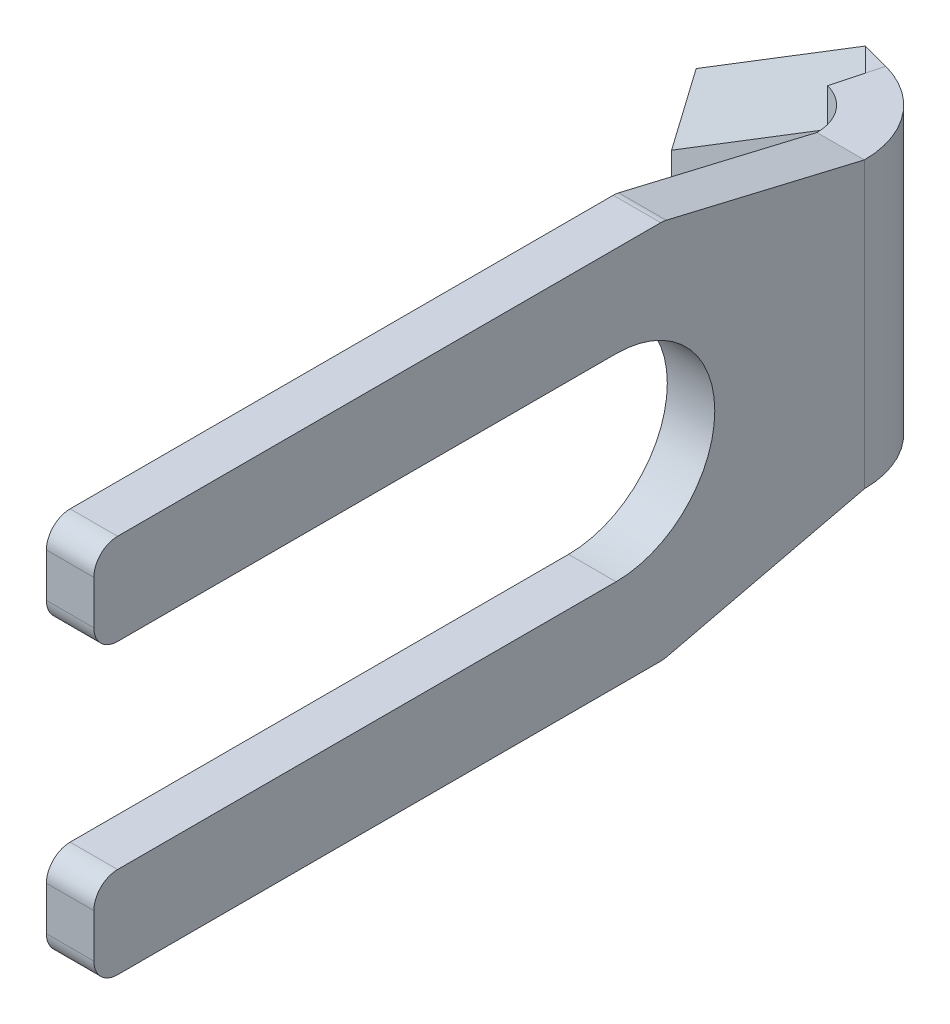
ISO-10303-21;
HEADER;
FILE_DESCRIPTION(('STEP AP214'),'2;1');
FILE_NAME('part.step','',(''),(''),'','','');
FILE_SCHEMA(('AUTOMOTIVE_DESIGN { 1 0 10303 214 1 1 1 1 }'));
ENDSEC;
DATA;
#1=APPLICATION_CONTEXT('core data for automotive mechanical design processes');
#2=APPLICATION_PROTOCOL_DEFINITION('international standard','automotive_design',2000,#1);
#3=PRODUCT_CONTEXT('',#1,'mechanical');
#4=PRODUCT('Part','Part','',(#3));
#5=PRODUCT_RELATED_PRODUCT_CATEGORY('part','',(#4));
#6=PRODUCT_DEFINITION_FORMATION('','',#4);
#7=PRODUCT_DEFINITION_CONTEXT('part definition',#1,'design');
#8=PRODUCT_DEFINITION('design','',#6,#7);
#9=PRODUCT_DEFINITION_SHAPE('','',#8);
#10=(LENGTH_UNIT() NAMED_UNIT(*) SI_UNIT(.MILLI.,.METRE.));
#11=(NAMED_UNIT(*) PLANE_ANGLE_UNIT() SI_UNIT($,.RADIAN.));
#12=(NAMED_UNIT(*) SI_UNIT($,.STERADIAN.) SOLID_ANGLE_UNIT());
#13=UNCERTAINTY_MEASURE_WITH_UNIT(LENGTH_MEASURE(1.E-05),#10,'distance_accuracy_value','');
#14=(GEOMETRIC_REPRESENTATION_CONTEXT(3) GLOBAL_UNCERTAINTY_ASSIGNED_CONTEXT((#13)) GLOBAL_UNIT_ASSIGNED_CONTEXT((#10,
#11,#12)) REPRESENTATION_CONTEXT('',''));
#15=CARTESIAN_POINT('',(0.,0.,0.));
#16=DIRECTION('',(0.,0.,1.));
#17=DIRECTION('',(1.,0.,0.));
#18=AXIS2_PLACEMENT_3D('',#15,#16,#17);
#19=CARTESIAN_POINT('',(-1.58749999999999,4.7625,-25.7693684065833));
#20=DIRECTION('',(0.,1.,0.));
#21=DIRECTION('',(0.999999999999999,0.,0.));
#22=AXIS2_PLACEMENT_3D('',#19,#20,#21);
#23=PLANE('',#22);
#24=DIRECTION('',(-0.258819045102518,0.,0.965925826289069));
#25=VECTOR('',#24,1.);
#26=CARTESIAN_POINT('',(-0.765749531799503,4.7625,-28.8361829050511));
#27=LINE('',#26,#25);
#28=CARTESIAN_POINT('',(-0.765749531799503,4.7625,-28.8361829050511));
#29=VERTEX_POINT('',#28);
#30=CARTESIAN_POINT('',(-0.907394282828822,4.7625,-28.3075574975843));
#31=VERTEX_POINT('',#30);
#32=EDGE_CURVE('E252',#29,#31,#27,.T.);
#33=ORIENTED_EDGE('',*,*,#32,.F.);
#34=DIRECTION('',(-0.965925826289068,0.,-0.258819045102518));
#35=VECTOR('',#34,1.);
#36=CARTESIAN_POINT('',(0.410875234100237,4.7625,-28.5209072492338));
#37=LINE('',#36,#35);
#38=CARTESIAN_POINT('',(-1.69301109144976,4.7625,-29.0846418911319));
#39=VERTEX_POINT('',#38);
#40=EDGE_CURVE('E225',#29,#39,#37,.T.);
#41=ORIENTED_EDGE('',*,*,#40,.T.);
#42=DIRECTION('',(0.710957016837405,0.,0.703235465693857));
#43=VECTOR('',#42,1.);
#44=CARTESIAN_POINT('',(0.0178584422237948,4.7625,-27.3923537432402));
#45=LINE('',#44,#43);
#46=EDGE_CURVE('E386',#39,#31,#45,.T.);
#47=ORIENTED_EDGE('',*,*,#46,.T.);
#48=EDGE_LOOP('',(#33,#41,#47));
#49=FACE_BOUND('',#48,.T.);
#50=ADVANCED_FACE('F39',(#49),#23,.T.);
#51=CARTESIAN_POINT('',(0.,4.7625,0.));
#52=DIRECTION('',(0.,0.,1.));
#53=DIRECTION('',(-0.999999999999999,0.,0.));
#54=AXIS2_PLACEMENT_3D('',#51,#52,#53);
#55=PLANE('',#54);
#56=DIRECTION('',(0.,-1.,0.));
#57=VECTOR('',#56,1.);
#58=CARTESIAN_POINT('',(1.58749999999999,4.7625,0.));
#59=LINE('',#58,#57);
#60=CARTESIAN_POINT('',(1.58749999999999,-4.09575,0.));
#61=VERTEX_POINT('',#60);
#62=CARTESIAN_POINT('',(1.58749999999999,-5.55625000000001,0.));
#63=VERTEX_POINT('',#62);
#64=EDGE_CURVE('E237',#61,#63,#59,.T.);
#65=ORIENTED_EDGE('',*,*,#64,.F.);
#66=DIRECTION('',(0.999999999999999,0.,0.));
#67=VECTOR('',#66,1.);
#68=CARTESIAN_POINT('',(1.58749999999999,-4.09575000000001,0.));
#69=LINE('',#68,#67);
#70=CARTESIAN_POINT('',(0.,-4.09575,0.));
#71=VERTEX_POINT('',#70);
#72=EDGE_CURVE('E295',#71,#61,#69,.T.);
#73=ORIENTED_EDGE('',*,*,#72,.F.);
#74=DIRECTION('',(0.,-1.,0.));
#75=VECTOR('',#74,1.);
#76=CARTESIAN_POINT('',(0.,4.7625,0.));
#77=LINE('',#76,#75);
#78=CARTESIAN_POINT('',(0.,-5.55625000000001,0.));
#79=VERTEX_POINT('',#78);
#80=EDGE_CURVE('E233',#71,#79,#77,.T.);
#81=ORIENTED_EDGE('',*,*,#80,.T.);
#82=DIRECTION('',(0.999999999999999,0.,0.));
#83=VECTOR('',#82,1.);
#84=CARTESIAN_POINT('',(0.,-5.55625000000001,0.));
#85=LINE('',#84,#83);
#86=EDGE_CURVE('E298',#63,#79,#85,.F.);
#87=ORIENTED_EDGE('',*,*,#86,.F.);
#88=EDGE_LOOP('',(#65,#73,#81,#87));
#89=FACE_BOUND('',#88,.T.);
#90=ADVANCED_FACE('F412',(#89),#55,.T.);
#91=CARTESIAN_POINT('',(0.,4.7625,-26.9874999999999));
#92=DIRECTION('',(0.258819045102518,0.,-0.965925826289069));
#93=DIRECTION('',(0.965925826289068,0.,0.258819045102518));
#94=AXIS2_PLACEMENT_3D('',#91,#92,#93);
#95=PLANE('',#94);
#96=DIRECTION('',(-0.965925826289068,0.,-0.258819045102518));
#97=VECTOR('',#96,1.);
#98=CARTESIAN_POINT('',(0.,-4.76250000000001,-26.9874999999999));
#99=LINE('',#98,#97);
#100=CARTESIAN_POINT('',(-1.17662476589975,-4.76250000000001,-27.3027756558172));
#101=VERTEX_POINT('',#100);
#102=CARTESIAN_POINT('',(-8.30493366185076,-4.76250000000002,-29.2128002678869));
#103=VERTEX_POINT('',#102);
#104=EDGE_CURVE('E201',#101,#103,#99,.T.);
#105=ORIENTED_EDGE('',*,*,#104,.F.);
#106=DIRECTION('',(0.,-1.,0.));
#107=VECTOR('',#106,1.);
#108=CARTESIAN_POINT('',(-1.17662476589975,4.7625,-27.3027756558173));
#109=LINE('',#108,#107);
#110=CARTESIAN_POINT('',(-1.17662476589975,3.49637062221248,-27.3027756558172));
#111=VERTEX_POINT('',#110);
#112=EDGE_CURVE('E230',#111,#101,#109,.T.);
#113=ORIENTED_EDGE('',*,*,#112,.F.);
#114=DIRECTION('',(-0.793585441894477,-0.570093089663073,-0.212640578280719));
#115=VECTOR('',#114,1.);
#116=CARTESIAN_POINT('',(-9.83834091108468,-2.72600224189255,-29.6236755019871));
#117=LINE('',#116,#115);
#118=CARTESIAN_POINT('',(-8.30493366185076,-1.62443859130362,-29.2128002678869));
#119=VERTEX_POINT('',#118);
#120=EDGE_CURVE('E203',#111,#119,#117,.T.);
#121=ORIENTED_EDGE('',*,*,#120,.T.);
#122=DIRECTION('',(0.,-1.,0.));
#123=VECTOR('',#122,1.);
#124=CARTESIAN_POINT('',(-8.30493366185076,6.34999999999999,-29.2128002678869));
#125=LINE('',#124,#123);
#126=EDGE_CURVE('E188',#119,#103,#125,.T.);
#127=ORIENTED_EDGE('',*,*,#126,.T.);
#128=EDGE_LOOP('',(#105,#113,#121,#127));
#129=FACE_BOUND('',#128,.T.);
#130=ADVANCED_FACE('F199',(#129),#95,.F.);
#131=CARTESIAN_POINT('',(0.410875234100237,4.7625,-28.5209072492338));
#132=DIRECTION('',(0.258819045102518,0.,-0.965925826289069));
#133=DIRECTION('',(0.965925826289068,0.,0.258819045102518));
#134=AXIS2_PLACEMENT_3D('',#131,#132,#133);
#135=PLANE('',#134);
#136=ORIENTED_EDGE('',*,*,#40,.F.);
#137=DIRECTION('',(0.,-1.,0.));
#138=VECTOR('',#137,1.);
#139=CARTESIAN_POINT('',(-0.765749531799503,4.7625,-28.8361829050511));
#140=LINE('',#139,#138);
#141=CARTESIAN_POINT('',(-0.76574953179951,-4.76250000000001,-28.8361829050511));
#142=VERTEX_POINT('',#141);
#143=EDGE_CURVE('E244',#29,#142,#140,.T.);
#144=ORIENTED_EDGE('',*,*,#143,.T.);
#145=DIRECTION('',(-0.965925826289068,0.,-0.258819045102518));
#146=VECTOR('',#145,1.);
#147=CARTESIAN_POINT('',(0.410875234100237,-4.76250000000001,-28.5209072492339));
#148=LINE('',#147,#146);
#149=CARTESIAN_POINT('',(-9.42746567698444,-4.76250000000002,-31.157082751221));
#150=VERTEX_POINT('',#149);
#151=EDGE_CURVE('E211',#142,#150,#148,.T.);
#152=ORIENTED_EDGE('',*,*,#151,.T.);
#153=DIRECTION('',(0.,-1.,0.));
#154=VECTOR('',#153,1.);
#155=CARTESIAN_POINT('',(-9.42746567698444,4.7625,-31.157082751221));
#156=LINE('',#155,#154);
#157=CARTESIAN_POINT('',(-9.42746567698444,-0.79375000000001,-31.157082751221));
#158=VERTEX_POINT('',#157);
#159=EDGE_CURVE('E191',#158,#150,#156,.T.);
#160=ORIENTED_EDGE('',*,*,#159,.F.);
#161=DIRECTION('',(0.793585441894477,0.570093089663073,0.212640578280719));
#162=VECTOR('',#161,1.);
#163=CARTESIAN_POINT('',(-0.272900720381442,5.7826738418641,-28.704124464041));
#164=LINE('',#163,#162);
#165=EDGE_CURVE('E212',#158,#39,#164,.T.);
#166=ORIENTED_EDGE('',*,*,#165,.T.);
#167=EDGE_LOOP('',(#136,#144,#152,#160,#166));
#168=FACE_BOUND('',#167,.T.);
#169=ADVANCED_FACE('F469',(#168),#135,.T.);
#170=CARTESIAN_POINT('',(0.,4.7625,-25.7693684065833));
#171=DIRECTION('',(0.,1.,0.));
#172=DIRECTION('',(0.,0.,-1.));
#173=AXIS2_PLACEMENT_3D('',#170,#171,#172);
#174=PLANE('',#173);
#175=DIRECTION('',(0.999999999999999,0.,0.));
#176=VECTOR('',#175,1.);
#177=CARTESIAN_POINT('',(0.,4.7625,-25.7693684065833));
#178=LINE('',#177,#176);
#179=CARTESIAN_POINT('',(0.,4.7625,-25.7693684065833));
#180=VERTEX_POINT('',#179);
#181=CARTESIAN_POINT('',(1.58749999999999,4.7625,-25.7693684065833));
#182=VERTEX_POINT('',#181);
#183=EDGE_CURVE('E255',#180,#182,#178,.T.);
#184=ORIENTED_EDGE('',*,*,#183,.T.);
#185=CARTESIAN_POINT('',(-1.58749999999999,4.7625,-25.7693684065833));
#186=DIRECTION('',(0.,-1.,0.));
#187=DIRECTION('',(0.999999999999999,0.,0.));
#188=AXIS2_PLACEMENT_3D('',#185,#186,#187);
#189=CIRCLE('',#188,3.175);
#190=EDGE_CURVE('E369',#182,#29,#189,.F.);
#191=ORIENTED_EDGE('',*,*,#190,.T.);
#192=ORIENTED_EDGE('',*,*,#32,.T.);
#193=DIRECTION('',(-0.258819045102518,0.,0.965925826289069));
#194=VECTOR('',#193,1.);
#195=CARTESIAN_POINT('',(-0.604849140016933,4.7625,-29.4366713421414));
#196=LINE('',#195,#194);
#197=CARTESIAN_POINT('',(-1.17662476589975,4.7625,-27.3027756558173));
#198=VERTEX_POINT('',#197);
#199=EDGE_CURVE('E392',#31,#198,#196,.T.);
#200=ORIENTED_EDGE('',*,*,#199,.T.);
#201=CARTESIAN_POINT('',(-1.58749999999999,4.7625,-25.7693684065833));
#202=DIRECTION('',(0.,-1.,0.));
#203=DIRECTION('',(0.,0.,-1.));
#204=AXIS2_PLACEMENT_3D('',#201,#202,#203);
#205=CIRCLE('',#204,1.5875);
#206=EDGE_CURVE('E219',#180,#198,#205,.F.);
#207=ORIENTED_EDGE('',*,*,#206,.F.);
#208=EDGE_LOOP('',(#184,#191,#192,#200,#207));
#209=FACE_BOUND('',#208,.T.);
#210=ADVANCED_FACE('F437',(#209),#174,.T.);
#211=CARTESIAN_POINT('',(-1.17662476589975,-4.76250000000001,-27.3027756558172));
#212=DIRECTION('',(0.,-1.,0.));
#213=DIRECTION('',(0.,0.,1.));
#214=AXIS2_PLACEMENT_3D('',#211,#212,#213);
#215=PLANE('',#214);
#216=DIRECTION('',(0.258819045102518,0.,-0.965925826289069));
#217=VECTOR('',#216,1.);
#218=CARTESIAN_POINT('',(-1.17662476589975,-4.76250000000001,-27.3027756558172));
#219=LINE('',#218,#217);
#220=EDGE_CURVE('E209',#101,#142,#219,.T.);
#221=ORIENTED_EDGE('',*,*,#220,.T.);
#222=CARTESIAN_POINT('',(-1.58749999999999,-4.76250000000001,-25.7693684065833));
#223=DIRECTION('',(0.,-1.,0.));
#224=DIRECTION('',(0.999999999999999,0.,0.));
#225=AXIS2_PLACEMENT_3D('',#222,#223,#224);
#226=CIRCLE('',#225,3.175);
#227=CARTESIAN_POINT('',(1.58749999999999,-4.76250000000001,-25.7693684065833));
#228=VERTEX_POINT('',#227);
#229=EDGE_CURVE('E214',#228,#142,#226,.F.);
#230=ORIENTED_EDGE('',*,*,#229,.F.);
#231=DIRECTION('',(-0.999999999999999,0.,0.));
#232=VECTOR('',#231,1.);
#233=CARTESIAN_POINT('',(1.58749999999999,-4.76250000000001,-25.7693684065833));
#234=LINE('',#233,#232);
#235=CARTESIAN_POINT('',(0.,-4.76250000000001,-25.7693684065833));
#236=VERTEX_POINT('',#235);
#237=EDGE_CURVE('E248',#228,#236,#234,.T.);
#238=ORIENTED_EDGE('',*,*,#237,.T.);
#239=CARTESIAN_POINT('',(-1.58749999999999,-4.76250000000001,-25.7693684065833));
#240=DIRECTION('',(0.,-1.,0.));
#241=DIRECTION('',(0.,0.,-1.));
#242=AXIS2_PLACEMENT_3D('',#239,#240,#241);
#243=CIRCLE('',#242,1.5875);
#244=EDGE_CURVE('E223',#236,#101,#243,.F.);
#245=ORIENTED_EDGE('',*,*,#244,.T.);
#246=EDGE_LOOP('',(#221,#230,#238,#245));
#247=FACE_BOUND('',#246,.T.);
#248=ADVANCED_FACE('F425',(#247),#215,.T.);
#249=CARTESIAN_POINT('',(1.58749999999999,-4.76250000000001,-25.7693684065833));
#250=DIRECTION('',(0.,-1.,0.));
#251=DIRECTION('',(0.,0.,1.));
#252=AXIS2_PLACEMENT_3D('',#249,#250,#251);
#253=PLANE('',#252);
#254=DIRECTION('',(-0.500000000000007,0.,-0.866025403784434));
#255=VECTOR('',#254,1.);
#256=CARTESIAN_POINT('',(-9.42746567698444,-4.76250000000002,-31.157082751221));
#257=LINE('',#256,#255);
#258=EDGE_CURVE('E185',#103,#150,#257,.T.);
#259=ORIENTED_EDGE('',*,*,#258,.T.);
#260=ORIENTED_EDGE('',*,*,#151,.F.);
#261=ORIENTED_EDGE('',*,*,#220,.F.);
#262=ORIENTED_EDGE('',*,*,#104,.T.);
#263=EDGE_LOOP('',(#259,#260,#261,#262));
#264=FACE_BOUND('',#263,.T.);
#265=ADVANCED_FACE('F207',(#264),#253,.T.);
#266=CARTESIAN_POINT('',(-1.58749999999999,4.7625,-25.7693684065833));
#267=DIRECTION('',(0.,-1.,0.));
#268=DIRECTION('',(0.,0.,1.));
#269=AXIS2_PLACEMENT_3D('',#266,#267,#268);
#270=CYLINDRICAL_SURFACE('',#269,3.175);
#271=ORIENTED_EDGE('',*,*,#229,.T.);
#272=ORIENTED_EDGE('',*,*,#143,.F.);
#273=ORIENTED_EDGE('',*,*,#190,.F.);
#274=DIRECTION('',(0.,-1.,0.));
#275=VECTOR('',#274,1.);
#276=CARTESIAN_POINT('',(1.58749999999999,4.7625,-25.7693684065833));
#277=LINE('',#276,#275);
#278=EDGE_CURVE('E241',#182,#228,#277,.T.);
#279=ORIENTED_EDGE('',*,*,#278,.T.);
#280=EDGE_LOOP('',(#271,#272,#273,#279));
#281=FACE_BOUND('',#280,.T.);
#282=ADVANCED_FACE('F427',(#281),#270,.T.);
#283=CARTESIAN_POINT('',(1.58749999999999,4.7625,0.));
#284=DIRECTION('',(0.999999999999999,0.,0.));
#285=DIRECTION('',(0.,0.,1.));
#286=AXIS2_PLACEMENT_3D('',#283,#284,#285);
#287=PLANE('',#286);
#288=DIRECTION('',(0.,-0.229927463379789,0.973207768970088));
#289=VECTOR('',#288,1.);
#290=CARTESIAN_POINT('',(1.58749999999999,-4.76250000000001,-25.7693684065833));
#291=LINE('',#290,#289);
#292=CARTESIAN_POINT('',(1.58749999999999,-6.32873366662003,-19.1400134353621));
#293=VERTEX_POINT('',#292);
#294=EDGE_CURVE('E385',#228,#293,#291,.T.);
#295=ORIENTED_EDGE('',*,*,#294,.F.);
#296=ORIENTED_EDGE('',*,*,#278,.F.);
#297=DIRECTION('',(0.,-0.229927463379789,-0.973207768970088));
#298=VECTOR('',#297,1.);
#299=CARTESIAN_POINT('',(1.58749999999999,4.7625,-25.7693684065833));
#300=LINE('',#299,#298);
#301=CARTESIAN_POINT('',(1.58749999999999,6.32873366662001,-19.1400134353621));
#302=VERTEX_POINT('',#301);
#303=EDGE_CURVE('E354',#302,#182,#300,.T.);
#304=ORIENTED_EDGE('',*,*,#303,.F.);
#305=CARTESIAN_POINT('',(1.58749999999999,5.55625,-18.9575085113044));
#306=DIRECTION('',(-0.999999999999999,0.,0.));
#307=DIRECTION('',(0.,0.,1.));
#308=AXIS2_PLACEMENT_3D('',#305,#306,#307);
#309=CIRCLE('',#308,0.79375);
#310=CARTESIAN_POINT('',(1.58749999999999,6.34999999999999,-18.9575085113044));
#311=VERTEX_POINT('',#310);
#312=EDGE_CURVE('E269',#311,#302,#309,.T.);
#313=ORIENTED_EDGE('',*,*,#312,.F.);
#314=DIRECTION('',(0.,0.,-1.));
#315=VECTOR('',#314,1.);
#316=CARTESIAN_POINT('',(1.58749999999999,6.34999999999999,-19.05));
#317=LINE('',#316,#315);
#318=CARTESIAN_POINT('',(1.58749999999999,6.34999999999999,-0.793749999999982));
#319=VERTEX_POINT('',#318);
#320=EDGE_CURVE('E350',#319,#311,#317,.T.);
#321=ORIENTED_EDGE('',*,*,#320,.F.);
#322=CARTESIAN_POINT('',(1.58749999999999,5.55625000000001,-0.793749999999926));
#323=DIRECTION('',(-0.999999999999999,0.,0.));
#324=DIRECTION('',(0.,0.,1.));
#325=AXIS2_PLACEMENT_3D('',#322,#323,#324);
#326=CIRCLE('',#325,0.79375);
#327=CARTESIAN_POINT('',(1.58749999999999,5.55625,0.));
#328=VERTEX_POINT('',#327);
#329=EDGE_CURVE('E260',#328,#319,#326,.T.);
#330=ORIENTED_EDGE('',*,*,#329,.F.);
#331=CARTESIAN_POINT('',(1.58749999999999,4.09574999999999,1.11022302462516E-13));
#332=VERTEX_POINT('',#331);
#333=EDGE_CURVE('E240',#328,#332,#59,.T.);
#334=ORIENTED_EDGE('',*,*,#333,.T.);
#335=CARTESIAN_POINT('',(1.58749999999999,4.09574999999999,-0.793749999999982));
#336=DIRECTION('',(-0.999999999999999,0.,0.));
#337=DIRECTION('',(0.,0.,1.));
#338=AXIS2_PLACEMENT_3D('',#335,#336,#337);
#339=CIRCLE('',#338,0.79375);
#340=CARTESIAN_POINT('',(1.58749999999999,3.30199999999999,-0.793749999999926));
#341=VERTEX_POINT('',#340);
#342=EDGE_CURVE('E263',#341,#332,#339,.T.);
#343=ORIENTED_EDGE('',*,*,#342,.F.);
#344=DIRECTION('',(0.,0.,-1.));
#345=VECTOR('',#344,1.);
#346=CARTESIAN_POINT('',(1.58749999999999,3.30199999999999,0.));
#347=LINE('',#346,#345);
#348=CARTESIAN_POINT('',(1.58749999999999,3.30199999999999,-17.4624999999999));
#349=VERTEX_POINT('',#348);
#350=EDGE_CURVE('E317',#341,#349,#347,.T.);
#351=ORIENTED_EDGE('',*,*,#350,.T.);
#352=CARTESIAN_POINT('',(1.58749999999999,0.,-17.4624999999999));
#353=DIRECTION('',(-0.999999999999999,0.,0.));
#354=DIRECTION('',(0.,0.,1.));
#355=AXIS2_PLACEMENT_3D('',#352,#353,#354);
#356=CIRCLE('',#355,3.302);
#357=CARTESIAN_POINT('',(1.58749999999999,-3.30200000000001,-17.4625));
#358=VERTEX_POINT('',#357);
#359=EDGE_CURVE('E323',#349,#358,#356,.T.);
#360=ORIENTED_EDGE('',*,*,#359,.T.);
#361=DIRECTION('',(0.,0.,1.));
#362=VECTOR('',#361,1.);
#363=CARTESIAN_POINT('',(1.58749999999999,-3.30200000000001,0.));
#364=LINE('',#363,#362);
#365=CARTESIAN_POINT('',(1.58749999999999,-3.30200000000001,-0.793749999999926));
#366=VERTEX_POINT('',#365);
#367=EDGE_CURVE('E361',#358,#366,#364,.T.);
#368=ORIENTED_EDGE('',*,*,#367,.T.);
#369=CARTESIAN_POINT('',(1.58749999999999,-4.09575000000001,-0.793749999999982));
#370=DIRECTION('',(-0.999999999999999,0.,0.));
#371=DIRECTION('',(0.,0.,1.));
#372=AXIS2_PLACEMENT_3D('',#369,#370,#371);
#373=CIRCLE('',#372,0.79375);
#374=EDGE_CURVE('E266',#61,#366,#373,.T.);
#375=ORIENTED_EDGE('',*,*,#374,.F.);
#376=ORIENTED_EDGE('',*,*,#64,.T.);
#377=CARTESIAN_POINT('',(1.58749999999999,-5.55625000000001,-0.793749999999982));
#378=DIRECTION('',(-0.999999999999999,0.,0.));
#379=DIRECTION('',(0.,0.,1.));
#380=AXIS2_PLACEMENT_3D('',#377,#378,#379);
#381=CIRCLE('',#380,0.79375);
#382=CARTESIAN_POINT('',(1.58749999999999,-6.35000000000002,-0.793749999999982));
#383=VERTEX_POINT('',#382);
#384=EDGE_CURVE('E272',#383,#63,#381,.T.);
#385=ORIENTED_EDGE('',*,*,#384,.F.);
#386=DIRECTION('',(0.,0.,1.));
#387=VECTOR('',#386,1.);
#388=CARTESIAN_POINT('',(1.58749999999999,-6.35000000000002,0.));
#389=LINE('',#388,#387);
#390=CARTESIAN_POINT('',(1.58749999999999,-6.35000000000002,-18.9575085113044));
#391=VERTEX_POINT('',#390);
#392=EDGE_CURVE('E389',#391,#383,#389,.T.);
#393=ORIENTED_EDGE('',*,*,#392,.F.);
#394=CARTESIAN_POINT('',(1.58749999999999,-5.55625000000001,-18.9575085113044));
#395=DIRECTION('',(-0.999999999999999,0.,0.));
#396=DIRECTION('',(0.,0.,1.));
#397=AXIS2_PLACEMENT_3D('',#394,#395,#396);
#398=CIRCLE('',#397,0.79375);
#399=EDGE_CURVE('E274',#293,#391,#398,.T.);
#400=ORIENTED_EDGE('',*,*,#399,.F.);
#401=EDGE_LOOP('',(#295,#296,#304,#313,#321,#330,#334,#343,#351,#360,#368,#375,#376,#385,#393,#400));
#402=FACE_BOUND('',#401,.T.);
#403=ADVANCED_FACE('F326',(#402),#287,.T.);
#404=ORIENTED_EDGE('',*,*,#333,.F.);
#405=DIRECTION('',(0.999999999999999,0.,0.));
#406=VECTOR('',#405,1.);
#407=CARTESIAN_POINT('',(0.,5.55625,0.));
#408=LINE('',#407,#406);
#409=CARTESIAN_POINT('',(0.,5.55625,0.));
#410=VERTEX_POINT('',#409);
#411=EDGE_CURVE('E309',#410,#328,#408,.T.);
#412=ORIENTED_EDGE('',*,*,#411,.F.);
#413=CARTESIAN_POINT('',(0.,4.09574999999999,1.11022302462516E-13));
#414=VERTEX_POINT('',#413);
#415=EDGE_CURVE('E234',#410,#414,#77,.T.);
#416=ORIENTED_EDGE('',*,*,#415,.T.);
#417=DIRECTION('',(-0.999999999999999,0.,0.));
#418=VECTOR('',#417,1.);
#419=CARTESIAN_POINT('',(0.,4.09574999999999,1.11022302462516E-13));
#420=LINE('',#419,#418);
#421=EDGE_CURVE('E311',#332,#414,#420,.T.);
#422=ORIENTED_EDGE('',*,*,#421,.F.);
#423=EDGE_LOOP('',(#404,#412,#416,#422));
#424=FACE_BOUND('',#423,.T.);
#425=ADVANCED_FACE('F332',(#424),#55,.T.);
#426=CARTESIAN_POINT('',(0.,4.7625,0.));
#427=DIRECTION('',(0.999999999999999,0.,0.));
#428=DIRECTION('',(0.,0.,1.));
#429=AXIS2_PLACEMENT_3D('',#426,#427,#428);
#430=PLANE('',#429);
#431=DIRECTION('',(0.,0.,1.));
#432=VECTOR('',#431,1.);
#433=CARTESIAN_POINT('',(0.,-6.35000000000002,0.));
#434=LINE('',#433,#432);
#435=CARTESIAN_POINT('',(0.,-6.35000000000002,-18.9575085113044));
#436=VERTEX_POINT('',#435);
#437=CARTESIAN_POINT('',(0.,-6.35000000000002,-0.793749999999982));
#438=VERTEX_POINT('',#437);
#439=EDGE_CURVE('E356',#436,#438,#434,.T.);
#440=ORIENTED_EDGE('',*,*,#439,.T.);
#441=CARTESIAN_POINT('',(0.,-5.55625000000001,-0.793749999999982));
#442=DIRECTION('',(-0.999999999999999,0.,0.));
#443=DIRECTION('',(0.,0.,1.));
#444=AXIS2_PLACEMENT_3D('',#441,#442,#443);
#445=CIRCLE('',#444,0.79375);
#446=EDGE_CURVE('E289',#79,#438,#445,.F.);
#447=ORIENTED_EDGE('',*,*,#446,.F.);
#448=ORIENTED_EDGE('',*,*,#80,.F.);
#449=CARTESIAN_POINT('',(0.,-4.09575000000001,-0.793749999999982));
#450=DIRECTION('',(-0.999999999999999,0.,0.));
#451=DIRECTION('',(0.,0.,1.));
#452=AXIS2_PLACEMENT_3D('',#449,#450,#451);
#453=CIRCLE('',#452,0.79375);
#454=CARTESIAN_POINT('',(0.,-3.30200000000001,-0.793749999999926));
#455=VERTEX_POINT('',#454);
#456=EDGE_CURVE('E284',#455,#71,#453,.F.);
#457=ORIENTED_EDGE('',*,*,#456,.F.);
#458=DIRECTION('',(0.,0.,-1.));
#459=VECTOR('',#458,1.);
#460=CARTESIAN_POINT('',(0.,-3.30200000000001,0.));
#461=LINE('',#460,#459);
#462=CARTESIAN_POINT('',(0.,-3.30200000000001,-17.4625));
#463=VERTEX_POINT('',#462);
#464=EDGE_CURVE('E324',#455,#463,#461,.T.);
#465=ORIENTED_EDGE('',*,*,#464,.T.);
#466=CARTESIAN_POINT('',(0.,0.,-17.4624999999999));
#467=DIRECTION('',(-0.999999999999999,0.,0.));
#468=DIRECTION('',(0.,0.,1.));
#469=AXIS2_PLACEMENT_3D('',#466,#467,#468);
#470=CIRCLE('',#469,3.302);
#471=CARTESIAN_POINT('',(0.,3.30199999999999,-17.4624999999999));
#472=VERTEX_POINT('',#471);
#473=EDGE_CURVE('E344',#463,#472,#470,.F.);
#474=ORIENTED_EDGE('',*,*,#473,.T.);
#475=DIRECTION('',(0.,0.,1.));
#476=VECTOR('',#475,1.);
#477=CARTESIAN_POINT('',(0.,3.30199999999999,0.));
#478=LINE('',#477,#476);
#479=CARTESIAN_POINT('',(0.,3.30199999999999,-0.793749999999926));
#480=VERTEX_POINT('',#479);
#481=EDGE_CURVE('E216',#472,#480,#478,.T.);
#482=ORIENTED_EDGE('',*,*,#481,.T.);
#483=CARTESIAN_POINT('',(0.,4.09574999999999,-0.793749999999982));
#484=DIRECTION('',(-0.999999999999999,0.,0.));
#485=DIRECTION('',(0.,0.,1.));
#486=AXIS2_PLACEMENT_3D('',#483,#484,#485);
#487=CIRCLE('',#486,0.79375);
#488=EDGE_CURVE('E60',#414,#480,#487,.F.);
#489=ORIENTED_EDGE('',*,*,#488,.F.);
#490=ORIENTED_EDGE('',*,*,#415,.F.);
#491=CARTESIAN_POINT('',(0.,5.55625000000001,-0.793749999999926));
#492=DIRECTION('',(-0.999999999999999,0.,0.));
#493=DIRECTION('',(0.,0.,1.));
#494=AXIS2_PLACEMENT_3D('',#491,#492,#493);
#495=CIRCLE('',#494,0.79375);
#496=CARTESIAN_POINT('',(0.,6.34999999999999,-0.793749999999982));
#497=VERTEX_POINT('',#496);
#498=EDGE_CURVE('E281',#497,#410,#495,.F.);
#499=ORIENTED_EDGE('',*,*,#498,.F.);
#500=DIRECTION('',(0.,0.,-1.));
#501=VECTOR('',#500,1.);
#502=CARTESIAN_POINT('',(0.,6.34999999999999,-19.05));
#503=LINE('',#502,#501);
#504=CARTESIAN_POINT('',(0.,6.34999999999999,-18.9575085113044));
#505=VERTEX_POINT('',#504);
#506=EDGE_CURVE('E339',#497,#505,#503,.T.);
#507=ORIENTED_EDGE('',*,*,#506,.T.);
#508=CARTESIAN_POINT('',(0.,5.55625,-18.9575085113044));
#509=DIRECTION('',(-0.999999999999999,0.,0.));
#510=DIRECTION('',(0.,0.,1.));
#511=AXIS2_PLACEMENT_3D('',#508,#509,#510);
#512=CIRCLE('',#511,0.79375);
#513=CARTESIAN_POINT('',(0.,6.32873366662001,-19.1400134353621));
#514=VERTEX_POINT('',#513);
#515=EDGE_CURVE('E286',#514,#505,#512,.F.);
#516=ORIENTED_EDGE('',*,*,#515,.F.);
#517=DIRECTION('',(0.,-0.229927463379789,-0.973207768970088));
#518=VECTOR('',#517,1.);
#519=CARTESIAN_POINT('',(0.,4.7625,-25.7693684065833));
#520=LINE('',#519,#518);
#521=EDGE_CURVE('E345',#514,#180,#520,.T.);
#522=ORIENTED_EDGE('',*,*,#521,.T.);
#523=DIRECTION('',(0.,-1.,0.));
#524=VECTOR('',#523,1.);
#525=CARTESIAN_POINT('',(0.,4.7625,-25.7693684065833));
#526=LINE('',#525,#524);
#527=EDGE_CURVE('E229',#180,#236,#526,.T.);
#528=ORIENTED_EDGE('',*,*,#527,.T.);
#529=DIRECTION('',(0.,-0.229927463379789,0.973207768970088));
#530=VECTOR('',#529,1.);
#531=CARTESIAN_POINT('',(0.,-4.76250000000001,-25.7693684065833));
#532=LINE('',#531,#530);
#533=CARTESIAN_POINT('',(0.,-6.32873366662003,-19.1400134353621));
#534=VERTEX_POINT('',#533);
#535=EDGE_CURVE('E396',#236,#534,#532,.T.);
#536=ORIENTED_EDGE('',*,*,#535,.T.);
#537=CARTESIAN_POINT('',(0.,-5.55625000000001,-18.9575085113044));
#538=DIRECTION('',(-0.999999999999999,0.,0.));
#539=DIRECTION('',(0.,0.,1.));
#540=AXIS2_PLACEMENT_3D('',#537,#538,#539);
#541=CIRCLE('',#540,0.79375);
#542=EDGE_CURVE('E292',#436,#534,#541,.F.);
#543=ORIENTED_EDGE('',*,*,#542,.F.);
#544=EDGE_LOOP('',(#440,#447,#448,#457,#465,#474,#482,#489,#490,#499,#507,#516,#522,#528,#536,#543));
#545=FACE_BOUND('',#544,.T.);
#546=ADVANCED_FACE('F335',(#545),#430,.F.);
#547=CARTESIAN_POINT('',(-1.58749999999999,4.7625,-25.7693684065833));
#548=DIRECTION('',(0.,-1.,0.));
#549=DIRECTION('',(0.,0.,1.));
#550=AXIS2_PLACEMENT_3D('',#547,#548,#549);
#551=CYLINDRICAL_SURFACE('',#550,1.5875);
#552=ORIENTED_EDGE('',*,*,#244,.F.);
#553=ORIENTED_EDGE('',*,*,#527,.F.);
#554=ORIENTED_EDGE('',*,*,#206,.T.);
#555=EDGE_CURVE('E226',#198,#111,#109,.T.);
#556=ORIENTED_EDGE('',*,*,#555,.T.);
#557=ORIENTED_EDGE('',*,*,#112,.T.);
#558=EDGE_LOOP('',(#552,#553,#554,#556,#557));
#559=FACE_BOUND('',#558,.T.);
#560=ADVANCED_FACE('F378',(#559),#551,.F.);
#561=CARTESIAN_POINT('',(-9.83934091108468,-3.30200000000001,0.));
#562=DIRECTION('',(0.,-1.,0.));
#563=DIRECTION('',(0.,0.,1.));
#564=AXIS2_PLACEMENT_3D('',#561,#562,#563);
#565=PLANE('',#564);
#566=ORIENTED_EDGE('',*,*,#367,.F.);
#567=DIRECTION('',(0.999999999999999,0.,0.));
#568=VECTOR('',#567,1.);
#569=CARTESIAN_POINT('',(-9.83934091108467,-3.30200000000001,-17.4625));
#570=LINE('',#569,#568);
#571=EDGE_CURVE('E364',#463,#358,#570,.T.);
#572=ORIENTED_EDGE('',*,*,#571,.F.);
#573=ORIENTED_EDGE('',*,*,#464,.F.);
#574=DIRECTION('',(0.999999999999999,0.,0.));
#575=VECTOR('',#574,1.);
#576=CARTESIAN_POINT('',(0.,-3.30200000000001,-0.793749999999926));
#577=LINE('',#576,#575);
#578=EDGE_CURVE('E307',#366,#455,#577,.F.);
#579=ORIENTED_EDGE('',*,*,#578,.F.);
#580=EDGE_LOOP('',(#566,#572,#573,#579));
#581=FACE_BOUND('',#580,.T.);
#582=ADVANCED_FACE('F461',(#581),#565,.F.);
#583=CARTESIAN_POINT('',(-9.83934091108467,0.,-17.4624999999999));
#584=DIRECTION('',(0.999999999999999,0.,0.));
#585=DIRECTION('',(0.,0.,1.));
#586=AXIS2_PLACEMENT_3D('',#583,#584,#585);
#587=CYLINDRICAL_SURFACE('',#586,3.302);
#588=ORIENTED_EDGE('',*,*,#473,.F.);
#589=ORIENTED_EDGE('',*,*,#571,.T.);
#590=ORIENTED_EDGE('',*,*,#359,.F.);
#591=DIRECTION('',(0.999999999999999,0.,0.));
#592=VECTOR('',#591,1.);
#593=CARTESIAN_POINT('',(-9.83934091108467,3.30199999999999,-17.4624999999999));
#594=LINE('',#593,#592);
#595=EDGE_CURVE('E319',#472,#349,#594,.T.);
#596=ORIENTED_EDGE('',*,*,#595,.F.);
#597=EDGE_LOOP('',(#588,#589,#590,#596));
#598=FACE_BOUND('',#597,.T.);
#599=ADVANCED_FACE('F604',(#598),#587,.F.);
#600=CARTESIAN_POINT('',(-9.83934091108468,3.30199999999999,0.));
#601=DIRECTION('',(0.,1.,0.));
#602=DIRECTION('',(0.,0.,-1.));
#603=AXIS2_PLACEMENT_3D('',#600,#601,#602);
#604=PLANE('',#603);
#605=ORIENTED_EDGE('',*,*,#481,.F.);
#606=ORIENTED_EDGE('',*,*,#595,.T.);
#607=ORIENTED_EDGE('',*,*,#350,.F.);
#608=DIRECTION('',(-0.999999999999999,0.,0.));
#609=VECTOR('',#608,1.);
#610=CARTESIAN_POINT('',(1.58749999999999,3.30199999999999,-0.793749999999926));
#611=LINE('',#610,#609);
#612=EDGE_CURVE('E47',#480,#341,#611,.F.);
#613=ORIENTED_EDGE('',*,*,#612,.F.);
#614=EDGE_LOOP('',(#605,#606,#607,#613));
#615=FACE_BOUND('',#614,.T.);
#616=ADVANCED_FACE('F318',(#615),#604,.F.);
#617=CARTESIAN_POINT('',(0.,4.7625,-25.7693684065833));
#618=DIRECTION('',(0.,0.973207768970089,-0.229927463379789));
#619=DIRECTION('',(0.,-0.229927463379789,-0.973207768970088));
#620=AXIS2_PLACEMENT_3D('',#617,#618,#619);
#621=PLANE('',#620);
#622=ORIENTED_EDGE('',*,*,#303,.T.);
#623=ORIENTED_EDGE('',*,*,#183,.F.);
#624=ORIENTED_EDGE('',*,*,#521,.F.);
#625=DIRECTION('',(0.999999999999999,0.,0.));
#626=VECTOR('',#625,1.);
#627=CARTESIAN_POINT('',(0.,6.32873366662001,-19.1400134353621));
#628=LINE('',#627,#626);
#629=EDGE_CURVE('E305',#302,#514,#628,.F.);
#630=ORIENTED_EDGE('',*,*,#629,.F.);
#631=EDGE_LOOP('',(#622,#623,#624,#630));
#632=FACE_BOUND('',#631,.T.);
#633=ADVANCED_FACE('F433',(#632),#621,.T.);
#634=CARTESIAN_POINT('',(0.,6.34999999999999,-19.05));
#635=DIRECTION('',(0.,1.,0.));
#636=DIRECTION('',(0.,0.,-1.));
#637=AXIS2_PLACEMENT_3D('',#634,#635,#636);
#638=PLANE('',#637);
#639=ORIENTED_EDGE('',*,*,#506,.F.);
#640=DIRECTION('',(0.999999999999999,0.,0.));
#641=VECTOR('',#640,1.);
#642=CARTESIAN_POINT('',(0.,6.34999999999999,-0.793749999999982));
#643=LINE('',#642,#641);
#644=EDGE_CURVE('E301',#319,#497,#643,.F.);
#645=ORIENTED_EDGE('',*,*,#644,.F.);
#646=ORIENTED_EDGE('',*,*,#320,.T.);
#647=DIRECTION('',(0.999999999999999,0.,0.));
#648=VECTOR('',#647,1.);
#649=CARTESIAN_POINT('',(0.,6.34999999999999,-18.9575085113044));
#650=LINE('',#649,#648);
#651=EDGE_CURVE('E303',#505,#311,#650,.T.);
#652=ORIENTED_EDGE('',*,*,#651,.F.);
#653=EDGE_LOOP('',(#639,#645,#646,#652));
#654=FACE_BOUND('',#653,.T.);
#655=ADVANCED_FACE('F343',(#654),#638,.T.);
#656=CARTESIAN_POINT('',(0.,-6.35000000000002,0.));
#657=DIRECTION('',(0.,-1.,0.));
#658=DIRECTION('',(0.,0.,1.));
#659=AXIS2_PLACEMENT_3D('',#656,#657,#658);
#660=PLANE('',#659);
#661=ORIENTED_EDGE('',*,*,#392,.T.);
#662=DIRECTION('',(0.999999999999999,0.,0.));
#663=VECTOR('',#662,1.);
#664=CARTESIAN_POINT('',(0.,-6.35000000000002,-0.793749999999982));
#665=LINE('',#664,#663);
#666=EDGE_CURVE('E277',#438,#383,#665,.T.);
#667=ORIENTED_EDGE('',*,*,#666,.F.);
#668=ORIENTED_EDGE('',*,*,#439,.F.);
#669=DIRECTION('',(0.999999999999999,0.,0.));
#670=VECTOR('',#669,1.);
#671=CARTESIAN_POINT('',(0.,-6.35000000000002,-18.9575085113044));
#672=LINE('',#671,#670);
#673=EDGE_CURVE('E279',#391,#436,#672,.F.);
#674=ORIENTED_EDGE('',*,*,#673,.F.);
#675=EDGE_LOOP('',(#661,#667,#668,#674));
#676=FACE_BOUND('',#675,.T.);
#677=ADVANCED_FACE('F403',(#676),#660,.T.);
#678=CARTESIAN_POINT('',(0.,-4.76250000000001,-25.7693684065833));
#679=DIRECTION('',(0.,-0.973207768970088,-0.229927463379789));
#680=DIRECTION('',(0.,-0.229927463379789,0.973207768970088));
#681=AXIS2_PLACEMENT_3D('',#678,#679,#680);
#682=PLANE('',#681);
#683=ORIENTED_EDGE('',*,*,#535,.F.);
#684=ORIENTED_EDGE('',*,*,#237,.F.);
#685=ORIENTED_EDGE('',*,*,#294,.T.);
#686=DIRECTION('',(0.999999999999999,0.,0.));
#687=VECTOR('',#686,1.);
#688=CARTESIAN_POINT('',(0.,-6.32873366662003,-19.1400134353621));
#689=LINE('',#688,#687);
#690=EDGE_CURVE('E258',#534,#293,#689,.T.);
#691=ORIENTED_EDGE('',*,*,#690,.F.);
#692=EDGE_LOOP('',(#683,#684,#685,#691));
#693=FACE_BOUND('',#692,.T.);
#694=ADVANCED_FACE('F422',(#693),#682,.T.);
#695=CARTESIAN_POINT('',(0.,-5.55625000000001,-18.9575085113044));
#696=DIRECTION('',(0.999999999999999,0.,0.));
#697=DIRECTION('',(0.,0.,1.));
#698=AXIS2_PLACEMENT_3D('',#695,#696,#697);
#699=CYLINDRICAL_SURFACE('',#698,0.79375);
#700=ORIENTED_EDGE('',*,*,#542,.T.);
#701=ORIENTED_EDGE('',*,*,#690,.T.);
#702=ORIENTED_EDGE('',*,*,#399,.T.);
#703=ORIENTED_EDGE('',*,*,#673,.T.);
#704=EDGE_LOOP('',(#700,#701,#702,#703));
#705=FACE_BOUND('',#704,.T.);
#706=ADVANCED_FACE('F418',(#705),#699,.T.);
#707=CARTESIAN_POINT('',(0.,-5.55625000000001,-0.793749999999982));
#708=DIRECTION('',(0.999999999999999,0.,0.));
#709=DIRECTION('',(0.,0.,1.));
#710=AXIS2_PLACEMENT_3D('',#707,#708,#709);
#711=CYLINDRICAL_SURFACE('',#710,0.79375);
#712=ORIENTED_EDGE('',*,*,#446,.T.);
#713=ORIENTED_EDGE('',*,*,#666,.T.);
#714=ORIENTED_EDGE('',*,*,#384,.T.);
#715=ORIENTED_EDGE('',*,*,#86,.T.);
#716=EDGE_LOOP('',(#712,#713,#714,#715));
#717=FACE_BOUND('',#716,.T.);
#718=ADVANCED_FACE('F409',(#717),#711,.T.);
#719=CARTESIAN_POINT('',(0.,5.55625,-18.9575085113044));
#720=DIRECTION('',(0.999999999999999,0.,0.));
#721=DIRECTION('',(0.,0.,1.));
#722=AXIS2_PLACEMENT_3D('',#719,#720,#721);
#723=CYLINDRICAL_SURFACE('',#722,0.79375);
#724=ORIENTED_EDGE('',*,*,#515,.T.);
#725=ORIENTED_EDGE('',*,*,#651,.T.);
#726=ORIENTED_EDGE('',*,*,#312,.T.);
#727=ORIENTED_EDGE('',*,*,#629,.T.);
#728=EDGE_LOOP('',(#724,#725,#726,#727));
#729=FACE_BOUND('',#728,.T.);
#730=ADVANCED_FACE('F436',(#729),#723,.T.);
#731=CARTESIAN_POINT('',(0.,-4.09575000000001,-0.793749999999982));
#732=DIRECTION('',(-0.999999999999999,0.,0.));
#733=DIRECTION('',(0.,0.,-1.));
#734=AXIS2_PLACEMENT_3D('',#731,#732,#733);
#735=CYLINDRICAL_SURFACE('',#734,0.79375);
#736=ORIENTED_EDGE('',*,*,#456,.T.);
#737=ORIENTED_EDGE('',*,*,#72,.T.);
#738=ORIENTED_EDGE('',*,*,#374,.T.);
#739=ORIENTED_EDGE('',*,*,#578,.T.);
#740=EDGE_LOOP('',(#736,#737,#738,#739));
#741=FACE_BOUND('',#740,.T.);
#742=ADVANCED_FACE('F487',(#741),#735,.T.);
#743=CARTESIAN_POINT('',(0.,4.09574999999999,-0.793749999999982));
#744=DIRECTION('',(0.999999999999999,0.,0.));
#745=DIRECTION('',(0.,0.,1.));
#746=AXIS2_PLACEMENT_3D('',#743,#744,#745);
#747=CYLINDRICAL_SURFACE('',#746,0.79375);
#748=ORIENTED_EDGE('',*,*,#342,.T.);
#749=ORIENTED_EDGE('',*,*,#421,.T.);
#750=ORIENTED_EDGE('',*,*,#488,.T.);
#751=ORIENTED_EDGE('',*,*,#612,.T.);
#752=EDGE_LOOP('',(#748,#749,#750,#751));
#753=FACE_BOUND('',#752,.T.);
#754=ADVANCED_FACE('F313',(#753),#747,.T.);
#755=CARTESIAN_POINT('',(0.,5.55625000000001,-0.793749999999926));
#756=DIRECTION('',(0.999999999999999,0.,0.));
#757=DIRECTION('',(0.,0.,1.));
#758=AXIS2_PLACEMENT_3D('',#755,#756,#757);
#759=CYLINDRICAL_SURFACE('',#758,0.79375);
#760=ORIENTED_EDGE('',*,*,#498,.T.);
#761=ORIENTED_EDGE('',*,*,#411,.T.);
#762=ORIENTED_EDGE('',*,*,#329,.T.);
#763=ORIENTED_EDGE('',*,*,#644,.T.);
#764=EDGE_LOOP('',(#760,#761,#762,#763));
#765=FACE_BOUND('',#764,.T.);
#766=ADVANCED_FACE('F41',(#765),#759,.T.);
#767=CARTESIAN_POINT('',(-4.1035858516801,-18.8698548009126,-7.74412318850248));
#768=DIRECTION('',(0.572393523393075,-0.580944863613758,-0.578678425222897));
#769=DIRECTION('',(0.,-0.705723420720676,0.70848744057062));
#770=AXIS2_PLACEMENT_3D('',#767,#768,#769);
#771=PLANE('',#770);
#772=ORIENTED_EDGE('',*,*,#120,.F.);
#773=DIRECTION('',(-0.164300745418644,-0.772668823359507,0.613178729623846));
#774=VECTOR('',#773,1.);
#775=CARTESIAN_POINT('',(-0.785473767002054,5.33586429769204,-28.7625710571348));
#776=LINE('',#775,#774);
#777=EDGE_CURVE('E204',#31,#111,#776,.T.);
#778=ORIENTED_EDGE('',*,*,#777,.F.);
#779=ORIENTED_EDGE('',*,*,#46,.F.);
#780=ORIENTED_EDGE('',*,*,#165,.F.);
#781=DIRECTION('',(-0.468929908475992,0.347014356686893,-0.812210426669025));
#782=VECTOR('',#781,1.);
#783=CARTESIAN_POINT('',(3.60196014469139,-10.4356980561665,-8.58945523462917));
#784=LINE('',#783,#782);
#785=EDGE_CURVE('E11',#119,#158,#784,.T.);
#786=ORIENTED_EDGE('',*,*,#785,.F.);
#787=EDGE_LOOP('',(#772,#778,#779,#780,#786));
#788=FACE_BOUND('',#787,.T.);
#789=ADVANCED_FACE('F382',(#788),#771,.F.);
#790=CARTESIAN_POINT('',(-0.604849140016933,4.7625,-29.4366713421414));
#791=DIRECTION('',(0.965925826289068,0.,0.258819045102518));
#792=DIRECTION('',(-0.258819045102518,0.,0.965925826289069));
#793=AXIS2_PLACEMENT_3D('',#790,#791,#792);
#794=PLANE('',#793);
#795=ORIENTED_EDGE('',*,*,#199,.F.);
#796=ORIENTED_EDGE('',*,*,#777,.T.);
#797=ORIENTED_EDGE('',*,*,#555,.F.);
#798=EDGE_LOOP('',(#795,#796,#797));
#799=FACE_BOUND('',#798,.T.);
#800=ADVANCED_FACE('F440',(#799),#794,.F.);
#801=CARTESIAN_POINT('',(-9.42746567698444,6.34999999999999,-31.157082751221));
#802=DIRECTION('',(0.866025403784433,0.,-0.500000000000008));
#803=DIRECTION('',(0.500000000000007,0.,0.866025403784434));
#804=AXIS2_PLACEMENT_3D('',#801,#802,#803);
#805=PLANE('',#804);
#806=ORIENTED_EDGE('',*,*,#126,.F.);
#807=ORIENTED_EDGE('',*,*,#785,.T.);
#808=ORIENTED_EDGE('',*,*,#159,.T.);
#809=ORIENTED_EDGE('',*,*,#258,.F.);
#810=EDGE_LOOP('',(#806,#807,#808,#809));
#811=FACE_BOUND('',#810,.T.);
#812=ADVANCED_FACE('F187',(#811),#805,.F.);
#813=CLOSED_SHELL('',(#50,#90,#130,#169,#210,#248,#265,#282,#403,#425,#546,#560,#582,#599,#616,
#633,#655,#677,#694,#706,#718,#730,#742,#754,#766,#789,#800,#812));
#814=MANIFOLD_SOLID_BREP('B2',#813);
#815=ADVANCED_BREP_SHAPE_REPRESENTATION('',(#18,#814),#14);
#816=SHAPE_DEFINITION_REPRESENTATION(#9,#815);
ENDSEC;
END-ISO-10303-21;
